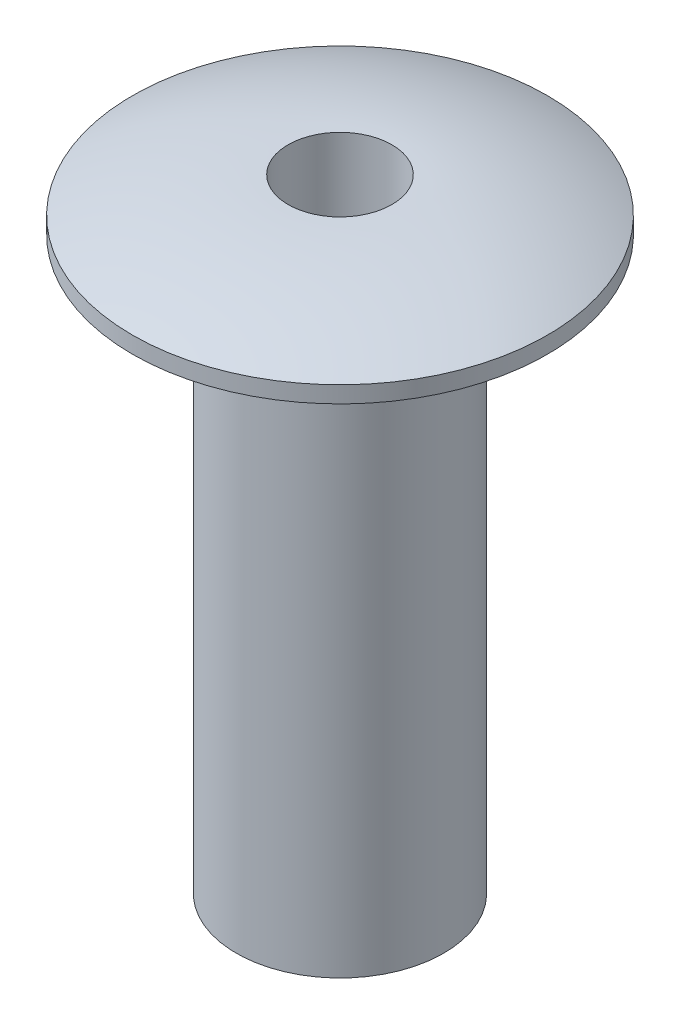
ISO-10303-21;
HEADER;
FILE_DESCRIPTION(('STEP AP214'),'2;1');
FILE_NAME('part.step','',(''),(''),'','','');
FILE_SCHEMA(('AUTOMOTIVE_DESIGN { 1 0 10303 214 1 1 1 1 }'));
ENDSEC;
DATA;
#1=APPLICATION_CONTEXT('core data for automotive mechanical design processes');
#2=APPLICATION_PROTOCOL_DEFINITION('international standard','automotive_design',2000,#1);
#3=PRODUCT_CONTEXT('',#1,'mechanical');
#4=PRODUCT('Part','Part','',(#3));
#5=PRODUCT_RELATED_PRODUCT_CATEGORY('part','',(#4));
#6=PRODUCT_DEFINITION_FORMATION('','',#4);
#7=PRODUCT_DEFINITION_CONTEXT('part definition',#1,'design');
#8=PRODUCT_DEFINITION('design','',#6,#7);
#9=PRODUCT_DEFINITION_SHAPE('','',#8);
#10=(LENGTH_UNIT() NAMED_UNIT(*) SI_UNIT(.MILLI.,.METRE.));
#11=(NAMED_UNIT(*) PLANE_ANGLE_UNIT() SI_UNIT($,.RADIAN.));
#12=(NAMED_UNIT(*) SI_UNIT($,.STERADIAN.) SOLID_ANGLE_UNIT());
#13=UNCERTAINTY_MEASURE_WITH_UNIT(LENGTH_MEASURE(1.E-05),#10,'distance_accuracy_value','');
#14=(GEOMETRIC_REPRESENTATION_CONTEXT(3) GLOBAL_UNCERTAINTY_ASSIGNED_CONTEXT((#13)) GLOBAL_UNIT_ASSIGNED_CONTEXT((#10,
#11,#12)) REPRESENTATION_CONTEXT('',''));
#15=CARTESIAN_POINT('',(0.,0.,0.));
#16=DIRECTION('',(0.,0.,1.));
#17=DIRECTION('',(1.,0.,0.));
#18=AXIS2_PLACEMENT_3D('',#15,#16,#17);
#19=CARTESIAN_POINT('',(0.,4.00236764705881,-0.79375));
#20=DIRECTION('',(1.,0.,0.));
#21=DIRECTION('',(0.,0.,-1.));
#22=AXIS2_PLACEMENT_3D('',#19,#20,#21);
#23=CIRCLE('',#22,5.52263235294119);
#24=TRIMMED_CURVE('',#23,(PARAMETER_VALUE(-1.71502257047458)),
(PARAMETER_VALUE(1.71502257047458)),.T.,.PARAMETER.);
#25=CARTESIAN_POINT('',(0.,4.00236764705881,0.));
#26=DIRECTION('',(0.,-1.,0.));
#27=AXIS1_PLACEMENT('',#25,#26);
#28=SURFACE_OF_REVOLUTION('',#24,#27);
#29=CARTESIAN_POINT('',(0.,9.525,0.));
#30=DIRECTION('',(0.,-1.,0.));
#31=DIRECTION('',(0.,0.,-1.));
#32=AXIS2_PLACEMENT_3D('',#29,#30,#31);
#33=CIRCLE('',#32,0.79375);
#34=CARTESIAN_POINT('',(0.,9.525,-0.79375));
#35=VERTEX_POINT('',#34);
#36=EDGE_CURVE('E37',#35,#35,#33,.T.);
#37=ORIENTED_EDGE('',*,*,#36,.T.);
#38=EDGE_LOOP('',(#37));
#39=FACE_BOUND('',#38,.T.);
#40=CARTESIAN_POINT('',(0.,8.98525,0.));
#41=DIRECTION('',(0.,-1.,0.));
#42=DIRECTION('',(0.,0.,-1.));
#43=AXIS2_PLACEMENT_3D('',#40,#41,#42);
#44=CIRCLE('',#43,3.175);
#45=CARTESIAN_POINT('',(0.,8.98525,-3.175));
#46=VERTEX_POINT('',#45);
#47=EDGE_CURVE('E31',#46,#46,#44,.T.);
#48=ORIENTED_EDGE('',*,*,#47,.F.);
#49=EDGE_LOOP('',(#48));
#50=FACE_BOUND('',#49,.T.);
#51=ADVANCED_FACE('F15',(#39,#50),#28,.F.);
#52=CARTESIAN_POINT('',(0.,0.,0.));
#53=DIRECTION('',(0.,-1.,0.));
#54=DIRECTION('',(0.,0.,-1.));
#55=AXIS2_PLACEMENT_3D('',#52,#53,#54);
#56=CYLINDRICAL_SURFACE('',#55,3.175);
#57=ORIENTED_EDGE('',*,*,#47,.T.);
#58=EDGE_LOOP('',(#57));
#59=FACE_BOUND('',#58,.T.);
#60=CARTESIAN_POINT('',(0.,8.73125,0.));
#61=DIRECTION('',(0.,-1.,0.));
#62=DIRECTION('',(0.,0.,-1.));
#63=AXIS2_PLACEMENT_3D('',#60,#61,#62);
#64=CIRCLE('',#63,3.175);
#65=CARTESIAN_POINT('',(0.,8.73125,-3.175));
#66=VERTEX_POINT('',#65);
#67=EDGE_CURVE('E19',#66,#66,#64,.T.);
#68=ORIENTED_EDGE('',*,*,#67,.F.);
#69=EDGE_LOOP('',(#68));
#70=FACE_BOUND('',#69,.T.);
#71=ADVANCED_FACE('F47',(#59,#70),#56,.T.);
#72=CARTESIAN_POINT('',(0.,0.,0.));
#73=DIRECTION('',(0.,-1.,0.));
#74=DIRECTION('',(0.,0.,-1.));
#75=AXIS2_PLACEMENT_3D('',#72,#73,#74);
#76=CYLINDRICAL_SURFACE('',#75,0.79375);
#77=CARTESIAN_POINT('',(0.,0.,0.));
#78=DIRECTION('',(0.,-1.,0.));
#79=DIRECTION('',(0.,0.,-1.));
#80=AXIS2_PLACEMENT_3D('',#77,#78,#79);
#81=CIRCLE('',#80,0.79375);
#82=CARTESIAN_POINT('',(0.,0.,-0.79375));
#83=VERTEX_POINT('',#82);
#84=EDGE_CURVE('E28',#83,#83,#81,.F.);
#85=ORIENTED_EDGE('',*,*,#84,.F.);
#86=EDGE_LOOP('',(#85));
#87=FACE_BOUND('',#86,.T.);
#88=ORIENTED_EDGE('',*,*,#36,.F.);
#89=EDGE_LOOP('',(#88));
#90=FACE_BOUND('',#89,.T.);
#91=ADVANCED_FACE('F55',(#87,#90),#76,.F.);
#92=CARTESIAN_POINT('',(0.,8.73125,-3.175));
#93=DIRECTION('',(0.,-1.,0.));
#94=DIRECTION('',(0.,0.,-1.));
#95=AXIS2_PLACEMENT_3D('',#92,#93,#94);
#96=PLANE('',#95);
#97=CARTESIAN_POINT('',(0.,8.73125,0.));
#98=DIRECTION('',(0.,-1.,0.));
#99=DIRECTION('',(0.,0.,-1.));
#100=AXIS2_PLACEMENT_3D('',#97,#98,#99);
#101=CIRCLE('',#100,1.5875);
#102=CARTESIAN_POINT('',(0.,8.73125,-1.5875));
#103=VERTEX_POINT('',#102);
#104=EDGE_CURVE('E23',#103,#103,#101,.T.);
#105=ORIENTED_EDGE('',*,*,#104,.F.);
#106=EDGE_LOOP('',(#105));
#107=FACE_BOUND('',#106,.T.);
#108=ORIENTED_EDGE('',*,*,#67,.T.);
#109=EDGE_LOOP('',(#108));
#110=FACE_BOUND('',#109,.T.);
#111=ADVANCED_FACE('F63',(#107,#110),#96,.T.);
#112=CARTESIAN_POINT('',(0.,0.,-1.5875));
#113=DIRECTION('',(0.,-1.,0.));
#114=DIRECTION('',(0.,0.,-1.));
#115=AXIS2_PLACEMENT_3D('',#112,#113,#114);
#116=PLANE('',#115);
#117=ORIENTED_EDGE('',*,*,#84,.T.);
#118=EDGE_LOOP('',(#117));
#119=FACE_BOUND('',#118,.T.);
#120=CARTESIAN_POINT('',(0.,0.,0.));
#121=DIRECTION('',(0.,-1.,0.));
#122=DIRECTION('',(0.,0.,-1.));
#123=AXIS2_PLACEMENT_3D('',#120,#121,#122);
#124=CIRCLE('',#123,1.5875);
#125=CARTESIAN_POINT('',(0.,0.,-1.5875));
#126=VERTEX_POINT('',#125);
#127=EDGE_CURVE('E10',#126,#126,#124,.F.);
#128=ORIENTED_EDGE('',*,*,#127,.F.);
#129=EDGE_LOOP('',(#128));
#130=FACE_BOUND('',#129,.T.);
#131=ADVANCED_FACE('F58',(#119,#130),#116,.T.);
#132=CARTESIAN_POINT('',(0.,0.,0.));
#133=DIRECTION('',(0.,-1.,0.));
#134=DIRECTION('',(0.,0.,-1.));
#135=AXIS2_PLACEMENT_3D('',#132,#133,#134);
#136=CYLINDRICAL_SURFACE('',#135,1.5875);
#137=ORIENTED_EDGE('',*,*,#127,.T.);
#138=EDGE_LOOP('',(#137));
#139=FACE_BOUND('',#138,.T.);
#140=ORIENTED_EDGE('',*,*,#104,.T.);
#141=EDGE_LOOP('',(#140));
#142=FACE_BOUND('',#141,.T.);
#143=ADVANCED_FACE('F56',(#139,#142),#136,.T.);
#144=CLOSED_SHELL('',(#51,#71,#91,#111,#131,#143));
#145=MANIFOLD_SOLID_BREP('B1',#144);
#146=ADVANCED_BREP_SHAPE_REPRESENTATION('',(#18,#145),#14);
#147=SHAPE_DEFINITION_REPRESENTATION(#9,#146);
ENDSEC;
END-ISO-10303-21;
